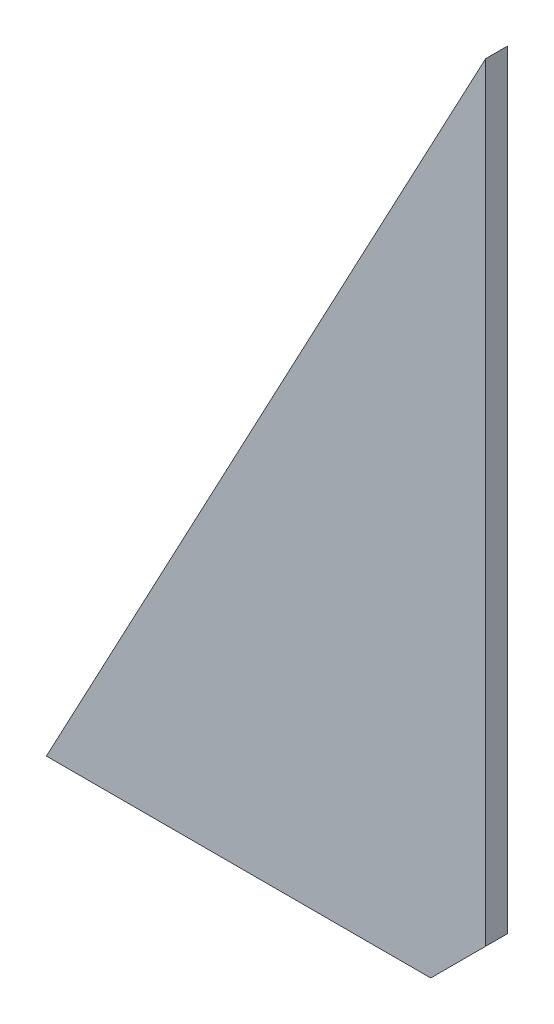
ISO-10303-21;
HEADER;
FILE_DESCRIPTION(('STEP AP214'),'2;1');
FILE_NAME('part.step','',(''),(''),'','','');
FILE_SCHEMA(('AUTOMOTIVE_DESIGN { 1 0 10303 214 1 1 1 1 }'));
ENDSEC;
DATA;
#1=APPLICATION_CONTEXT('core data for automotive mechanical design processes');
#2=APPLICATION_PROTOCOL_DEFINITION('international standard','automotive_design',2000,#1);
#3=PRODUCT_CONTEXT('',#1,'mechanical');
#4=PRODUCT('Part','Part','',(#3));
#5=PRODUCT_RELATED_PRODUCT_CATEGORY('part','',(#4));
#6=PRODUCT_DEFINITION_FORMATION('','',#4);
#7=PRODUCT_DEFINITION_CONTEXT('part definition',#1,'design');
#8=PRODUCT_DEFINITION('design','',#6,#7);
#9=PRODUCT_DEFINITION_SHAPE('','',#8);
#10=(LENGTH_UNIT() NAMED_UNIT(*) SI_UNIT(.MILLI.,.METRE.));
#11=(NAMED_UNIT(*) PLANE_ANGLE_UNIT() SI_UNIT($,.RADIAN.));
#12=(NAMED_UNIT(*) SI_UNIT($,.STERADIAN.) SOLID_ANGLE_UNIT());
#13=UNCERTAINTY_MEASURE_WITH_UNIT(LENGTH_MEASURE(1.E-05),#10,'distance_accuracy_value','');
#14=(GEOMETRIC_REPRESENTATION_CONTEXT(3) GLOBAL_UNCERTAINTY_ASSIGNED_CONTEXT((#13)) GLOBAL_UNIT_ASSIGNED_CONTEXT((#10,
#11,#12)) REPRESENTATION_CONTEXT('',''));
#15=CARTESIAN_POINT('',(0.,0.,0.));
#16=DIRECTION('',(0.,0.,1.));
#17=DIRECTION('',(1.,0.,0.));
#18=AXIS2_PLACEMENT_3D('',#15,#16,#17);
#19=CARTESIAN_POINT('',(80.,150.,2.));
#20=DIRECTION('',(0.882352941176471,-0.470588235294118,0.));
#21=DIRECTION('',(0.470588235294118,0.882352941176471,0.));
#22=AXIS2_PLACEMENT_3D('',#19,#20,#21);
#23=PLANE('',#22);
#24=DIRECTION('',(-0.470588235294118,-0.882352941176471,0.));
#25=VECTOR('',#24,1.);
#26=CARTESIAN_POINT('',(80.,150.,-2.));
#27=LINE('',#26,#25);
#28=CARTESIAN_POINT('',(80.,150.,-2.));
#29=VERTEX_POINT('',#28);
#30=CARTESIAN_POINT('',(0.,0.,-2.));
#31=VERTEX_POINT('',#30);
#32=EDGE_CURVE('E98',#29,#31,#27,.T.);
#33=ORIENTED_EDGE('',*,*,#32,.T.);
#34=DIRECTION('',(0.,0.,-1.));
#35=VECTOR('',#34,1.);
#36=CARTESIAN_POINT('',(0.,0.,2.));
#37=LINE('',#36,#35);
#38=CARTESIAN_POINT('',(0.,0.,2.));
#39=VERTEX_POINT('',#38);
#40=EDGE_CURVE('E11',#39,#31,#37,.T.);
#41=ORIENTED_EDGE('',*,*,#40,.F.);
#42=DIRECTION('',(-0.470588235294118,-0.882352941176471,0.));
#43=VECTOR('',#42,1.);
#44=CARTESIAN_POINT('',(80.,150.,2.));
#45=LINE('',#44,#43);
#46=CARTESIAN_POINT('',(80.,150.,2.));
#47=VERTEX_POINT('',#46);
#48=EDGE_CURVE('E86',#47,#39,#45,.T.);
#49=ORIENTED_EDGE('',*,*,#48,.F.);
#50=DIRECTION('',(0.,0.,-1.));
#51=VECTOR('',#50,1.);
#52=CARTESIAN_POINT('',(80.,150.,2.));
#53=LINE('',#52,#51);
#54=EDGE_CURVE('E94',#47,#29,#53,.T.);
#55=ORIENTED_EDGE('',*,*,#54,.T.);
#56=EDGE_LOOP('',(#33,#41,#49,#55));
#57=FACE_BOUND('',#56,.T.);
#58=ADVANCED_FACE('F35',(#57),#23,.F.);
#59=CARTESIAN_POINT('',(0.,0.,2.));
#60=DIRECTION('',(0.,1.,0.));
#61=DIRECTION('',(0.,0.,1.));
#62=AXIS2_PLACEMENT_3D('',#59,#60,#61);
#63=PLANE('',#62);
#64=DIRECTION('',(1.,0.,0.));
#65=VECTOR('',#64,1.);
#66=CARTESIAN_POINT('',(0.,0.,-2.));
#67=LINE('',#66,#65);
#68=CARTESIAN_POINT('',(70.,0.,-2.));
#69=VERTEX_POINT('',#68);
#70=EDGE_CURVE('E90',#31,#69,#67,.T.);
#71=ORIENTED_EDGE('',*,*,#70,.T.);
#72=DIRECTION('',(0.,0.,-1.));
#73=VECTOR('',#72,1.);
#74=CARTESIAN_POINT('',(70.,0.,2.));
#75=LINE('',#74,#73);
#76=CARTESIAN_POINT('',(70.,0.,2.));
#77=VERTEX_POINT('',#76);
#78=EDGE_CURVE('E43',#77,#69,#75,.T.);
#79=ORIENTED_EDGE('',*,*,#78,.F.);
#80=DIRECTION('',(1.,0.,0.));
#81=VECTOR('',#80,1.);
#82=CARTESIAN_POINT('',(0.,0.,2.));
#83=LINE('',#82,#81);
#84=EDGE_CURVE('E81',#39,#77,#83,.T.);
#85=ORIENTED_EDGE('',*,*,#84,.F.);
#86=ORIENTED_EDGE('',*,*,#40,.T.);
#87=EDGE_LOOP('',(#71,#79,#85,#86));
#88=FACE_BOUND('',#87,.T.);
#89=ADVANCED_FACE('F89',(#88),#63,.F.);
#90=CARTESIAN_POINT('',(70.,0.,2.));
#91=DIRECTION('',(-0.707106781186548,0.707106781186547,0.));
#92=DIRECTION('',(-0.707106781186547,-0.707106781186548,0.));
#93=AXIS2_PLACEMENT_3D('',#90,#91,#92);
#94=PLANE('',#93);
#95=DIRECTION('',(0.707106781186547,0.707106781186548,0.));
#96=VECTOR('',#95,1.);
#97=CARTESIAN_POINT('',(70.,0.,-2.));
#98=LINE('',#97,#96);
#99=CARTESIAN_POINT('',(80.,10.,-2.));
#100=VERTEX_POINT('',#99);
#101=EDGE_CURVE('E68',#69,#100,#98,.T.);
#102=ORIENTED_EDGE('',*,*,#101,.T.);
#103=DIRECTION('',(0.,0.,-1.));
#104=VECTOR('',#103,1.);
#105=CARTESIAN_POINT('',(80.,10.,2.));
#106=LINE('',#105,#104);
#107=CARTESIAN_POINT('',(80.,10.,2.));
#108=VERTEX_POINT('',#107);
#109=EDGE_CURVE('E91',#108,#100,#106,.T.);
#110=ORIENTED_EDGE('',*,*,#109,.F.);
#111=DIRECTION('',(0.707106781186547,0.707106781186548,0.));
#112=VECTOR('',#111,1.);
#113=CARTESIAN_POINT('',(70.,0.,2.));
#114=LINE('',#113,#112);
#115=EDGE_CURVE('E84',#77,#108,#114,.T.);
#116=ORIENTED_EDGE('',*,*,#115,.F.);
#117=ORIENTED_EDGE('',*,*,#78,.T.);
#118=EDGE_LOOP('',(#102,#110,#116,#117));
#119=FACE_BOUND('',#118,.T.);
#120=ADVANCED_FACE('F92',(#119),#94,.F.);
#121=CARTESIAN_POINT('',(80.,10.,2.));
#122=DIRECTION('',(-1.,0.,0.));
#123=DIRECTION('',(0.,0.,1.));
#124=AXIS2_PLACEMENT_3D('',#121,#122,#123);
#125=PLANE('',#124);
#126=DIRECTION('',(0.,1.,0.));
#127=VECTOR('',#126,1.);
#128=CARTESIAN_POINT('',(80.,10.,-2.));
#129=LINE('',#128,#127);
#130=EDGE_CURVE('E74',#100,#29,#129,.T.);
#131=ORIENTED_EDGE('',*,*,#130,.T.);
#132=ORIENTED_EDGE('',*,*,#54,.F.);
#133=DIRECTION('',(0.,1.,0.));
#134=VECTOR('',#133,1.);
#135=CARTESIAN_POINT('',(80.,10.,2.));
#136=LINE('',#135,#134);
#137=EDGE_CURVE('E51',#108,#47,#136,.T.);
#138=ORIENTED_EDGE('',*,*,#137,.F.);
#139=ORIENTED_EDGE('',*,*,#109,.T.);
#140=EDGE_LOOP('',(#131,#132,#138,#139));
#141=FACE_BOUND('',#140,.T.);
#142=ADVANCED_FACE('F105',(#141),#125,.F.);
#143=CARTESIAN_POINT('',(0.,0.,2.));
#144=DIRECTION('',(0.,0.,1.));
#145=DIRECTION('',(1.,0.,0.));
#146=AXIS2_PLACEMENT_3D('',#143,#144,#145);
#147=PLANE('',#146);
#148=ORIENTED_EDGE('',*,*,#48,.T.);
#149=ORIENTED_EDGE('',*,*,#84,.T.);
#150=ORIENTED_EDGE('',*,*,#115,.T.);
#151=ORIENTED_EDGE('',*,*,#137,.T.);
#152=EDGE_LOOP('',(#148,#149,#150,#151));
#153=FACE_BOUND('',#152,.T.);
#154=ADVANCED_FACE('F82',(#153),#147,.T.);
#155=CARTESIAN_POINT('',(0.,0.,-2.));
#156=DIRECTION('',(0.,0.,1.));
#157=DIRECTION('',(1.,0.,0.));
#158=AXIS2_PLACEMENT_3D('',#155,#156,#157);
#159=PLANE('',#158);
#160=ORIENTED_EDGE('',*,*,#32,.F.);
#161=ORIENTED_EDGE('',*,*,#130,.F.);
#162=ORIENTED_EDGE('',*,*,#101,.F.);
#163=ORIENTED_EDGE('',*,*,#70,.F.);
#164=EDGE_LOOP('',(#160,#161,#162,#163));
#165=FACE_BOUND('',#164,.T.);
#166=ADVANCED_FACE('F108',(#165),#159,.F.);
#167=CLOSED_SHELL('',(#58,#89,#120,#142,#154,#166));
#168=MANIFOLD_SOLID_BREP('B2',#167);
#169=ADVANCED_BREP_SHAPE_REPRESENTATION('',(#18,#168),#14);
#170=SHAPE_DEFINITION_REPRESENTATION(#9,#169);
ENDSEC;
END-ISO-10303-21;
